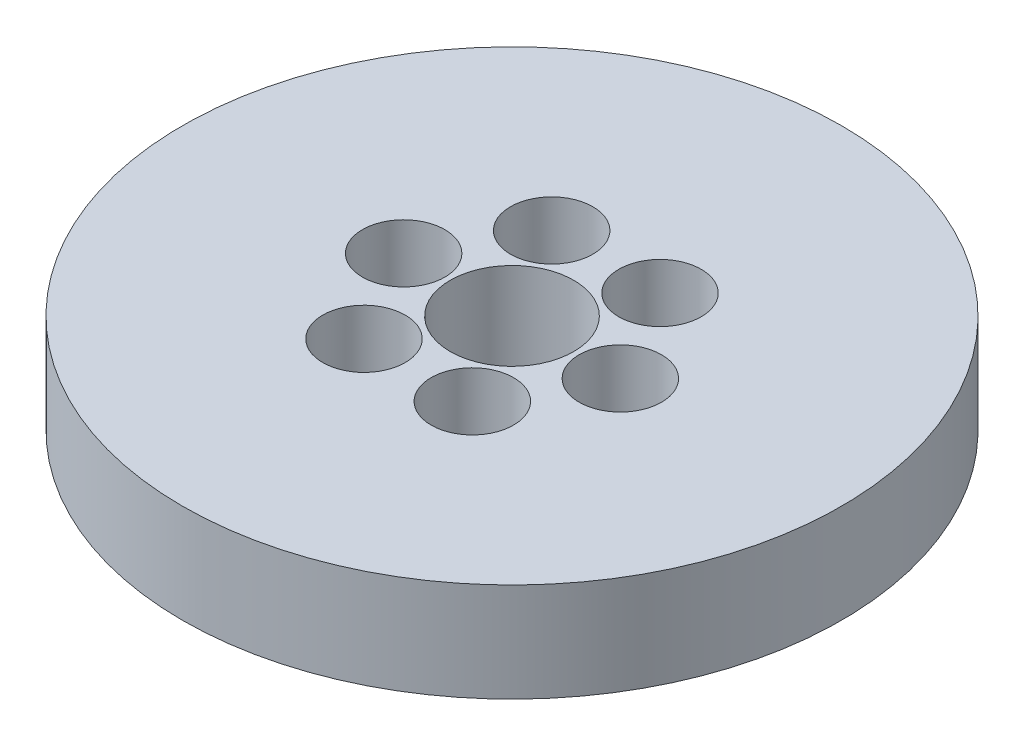
ISO-10303-21;
HEADER;
FILE_DESCRIPTION(('STEP AP214'),'2;1');
FILE_NAME('part.step','',(''),(''),'','','');
FILE_SCHEMA(('AUTOMOTIVE_DESIGN { 1 0 10303 214 1 1 1 1 }'));
ENDSEC;
DATA;
#1=APPLICATION_CONTEXT('core data for automotive mechanical design processes');
#2=APPLICATION_PROTOCOL_DEFINITION('international standard','automotive_design',2000,#1);
#3=PRODUCT_CONTEXT('',#1,'mechanical');
#4=PRODUCT('Part','Part','',(#3));
#5=PRODUCT_RELATED_PRODUCT_CATEGORY('part','',(#4));
#6=PRODUCT_DEFINITION_FORMATION('','',#4);
#7=PRODUCT_DEFINITION_CONTEXT('part definition',#1,'design');
#8=PRODUCT_DEFINITION('design','',#6,#7);
#9=PRODUCT_DEFINITION_SHAPE('','',#8);
#10=(LENGTH_UNIT() NAMED_UNIT(*) SI_UNIT(.MILLI.,.METRE.));
#11=(NAMED_UNIT(*) PLANE_ANGLE_UNIT() SI_UNIT($,.RADIAN.));
#12=(NAMED_UNIT(*) SI_UNIT($,.STERADIAN.) SOLID_ANGLE_UNIT());
#13=UNCERTAINTY_MEASURE_WITH_UNIT(LENGTH_MEASURE(1.E-05),#10,'distance_accuracy_value','');
#14=(GEOMETRIC_REPRESENTATION_CONTEXT(3) GLOBAL_UNCERTAINTY_ASSIGNED_CONTEXT((#13)) GLOBAL_UNIT_ASSIGNED_CONTEXT((#10,
#11,#12)) REPRESENTATION_CONTEXT('',''));
#15=CARTESIAN_POINT('',(0.,0.,0.));
#16=DIRECTION('',(0.,0.,1.));
#17=DIRECTION('',(1.,0.,0.));
#18=AXIS2_PLACEMENT_3D('',#15,#16,#17);
#19=CARTESIAN_POINT('',(0.,24.,0.));
#20=DIRECTION('',(0.,-1.,0.));
#21=DIRECTION('',(0.,0.,-1.));
#22=AXIS2_PLACEMENT_3D('',#19,#20,#21);
#23=CYLINDRICAL_SURFACE('',#22,80.);
#24=CARTESIAN_POINT('',(0.,24.,0.));
#25=DIRECTION('',(0.,1.,0.));
#26=DIRECTION('',(0.,0.,1.));
#27=AXIS2_PLACEMENT_3D('',#24,#25,#26);
#28=CIRCLE('',#27,80.);
#29=CARTESIAN_POINT('',(0.,24.,80.));
#30=VERTEX_POINT('',#29);
#31=EDGE_CURVE('E10',#30,#30,#28,.T.);
#32=ORIENTED_EDGE('',*,*,#31,.F.);
#33=EDGE_LOOP('',(#32));
#34=FACE_BOUND('',#33,.T.);
#35=CARTESIAN_POINT('',(0.,0.,0.));
#36=DIRECTION('',(0.,1.,0.));
#37=DIRECTION('',(0.,0.,1.));
#38=AXIS2_PLACEMENT_3D('',#35,#36,#37);
#39=CIRCLE('',#38,80.);
#40=CARTESIAN_POINT('',(0.,0.,80.));
#41=VERTEX_POINT('',#40);
#42=EDGE_CURVE('E37',#41,#41,#39,.T.);
#43=ORIENTED_EDGE('',*,*,#42,.T.);
#44=EDGE_LOOP('',(#43));
#45=FACE_BOUND('',#44,.T.);
#46=ADVANCED_FACE('F40',(#34,#45),#23,.T.);
#47=CARTESIAN_POINT('',(0.,24.,0.));
#48=DIRECTION('',(0.,1.,0.));
#49=DIRECTION('',(0.,0.,1.));
#50=AXIS2_PLACEMENT_3D('',#47,#48,#49);
#51=PLANE('',#50);
#52=CARTESIAN_POINT('',(-13.1505792721766,24.,-22.7774714483715));
#53=DIRECTION('',(0.,1.,0.));
#54=DIRECTION('',(-0.866025403784433,0.,0.50000000000001));
#55=AXIS2_PLACEMENT_3D('',#52,#53,#54);
#56=CIRCLE('',#55,10.);
#57=CARTESIAN_POINT('',(-21.810833310021,24.,-17.7774714483714));
#58=VERTEX_POINT('',#57);
#59=EDGE_CURVE('E70',#58,#58,#56,.T.);
#60=ORIENTED_EDGE('',*,*,#59,.F.);
#61=EDGE_LOOP('',(#60));
#62=FACE_BOUND('',#61,.T.);
#63=CARTESIAN_POINT('',(13.1505792721762,24.,-22.7774714483717));
#64=DIRECTION('',(0.,1.,0.));
#65=DIRECTION('',(-0.866025403784443,0.,-0.499999999999992));
#66=AXIS2_PLACEMENT_3D('',#63,#64,#65);
#67=CIRCLE('',#66,10.);
#68=CARTESIAN_POINT('',(4.49032523433172,24.,-27.7774714483716));
#69=VERTEX_POINT('',#68);
#70=EDGE_CURVE('E71',#69,#69,#67,.T.);
#71=ORIENTED_EDGE('',*,*,#70,.F.);
#72=EDGE_LOOP('',(#71));
#73=FACE_BOUND('',#72,.T.);
#74=CARTESIAN_POINT('',(26.3011585443527,24.,0.));
#75=DIRECTION('',(0.,1.,0.));
#76=DIRECTION('',(0.,0.,-1.));
#77=AXIS2_PLACEMENT_3D('',#74,#75,#76);
#78=CIRCLE('',#77,10.);
#79=CARTESIAN_POINT('',(26.3011585443527,24.,-10.));
#80=VERTEX_POINT('',#79);
#81=EDGE_CURVE('E78',#80,#80,#78,.T.);
#82=ORIENTED_EDGE('',*,*,#81,.F.);
#83=EDGE_LOOP('',(#82));
#84=FACE_BOUND('',#83,.T.);
#85=CARTESIAN_POINT('',(13.1505792721765,24.,22.7774714483716));
#86=DIRECTION('',(0.,1.,0.));
#87=DIRECTION('',(0.866025403784436,0.,-0.500000000000004));
#88=AXIS2_PLACEMENT_3D('',#85,#86,#87);
#89=CIRCLE('',#88,10.);
#90=CARTESIAN_POINT('',(21.8108333100208,24.,17.7774714483715));
#91=VERTEX_POINT('',#90);
#92=EDGE_CURVE('E84',#91,#91,#89,.T.);
#93=ORIENTED_EDGE('',*,*,#92,.F.);
#94=EDGE_LOOP('',(#93));
#95=FACE_BOUND('',#94,.T.);
#96=CARTESIAN_POINT('',(-13.1505792721763,24.,22.7774714483716));
#97=DIRECTION('',(0.,1.,0.));
#98=DIRECTION('',(0.86602540378444,0.,0.499999999999998));
#99=AXIS2_PLACEMENT_3D('',#96,#97,#98);
#100=CIRCLE('',#99,10.);
#101=CARTESIAN_POINT('',(-4.49032523433192,24.,27.7774714483716));
#102=VERTEX_POINT('',#101);
#103=EDGE_CURVE('E61',#102,#102,#100,.T.);
#104=ORIENTED_EDGE('',*,*,#103,.F.);
#105=EDGE_LOOP('',(#104));
#106=FACE_BOUND('',#105,.T.);
#107=CARTESIAN_POINT('',(-26.3011585443527,24.,0.));
#108=DIRECTION('',(0.,1.,0.));
#109=DIRECTION('',(0.,0.,1.));
#110=AXIS2_PLACEMENT_3D('',#107,#108,#109);
#111=CIRCLE('',#110,10.);
#112=CARTESIAN_POINT('',(-26.3011585443527,24.,10.));
#113=VERTEX_POINT('',#112);
#114=EDGE_CURVE('E54',#113,#113,#111,.T.);
#115=ORIENTED_EDGE('',*,*,#114,.F.);
#116=EDGE_LOOP('',(#115));
#117=FACE_BOUND('',#116,.T.);
#118=CARTESIAN_POINT('',(0.,24.,0.));
#119=DIRECTION('',(0.,1.,0.));
#120=DIRECTION('',(0.,0.,1.));
#121=AXIS2_PLACEMENT_3D('',#118,#119,#120);
#122=CIRCLE('',#121,15.);
#123=CARTESIAN_POINT('',(0.,24.,15.));
#124=VERTEX_POINT('',#123);
#125=EDGE_CURVE('E50',#124,#124,#122,.T.);
#126=ORIENTED_EDGE('',*,*,#125,.F.);
#127=EDGE_LOOP('',(#126));
#128=FACE_BOUND('',#127,.T.);
#129=ORIENTED_EDGE('',*,*,#31,.T.);
#130=EDGE_LOOP('',(#129));
#131=FACE_BOUND('',#130,.T.);
#132=ADVANCED_FACE('F99',(#62,#73,#84,#95,#106,#117,#128,#131),#51,.T.);
#133=CARTESIAN_POINT('',(0.,0.,0.));
#134=DIRECTION('',(0.,1.,0.));
#135=DIRECTION('',(0.,0.,1.));
#136=AXIS2_PLACEMENT_3D('',#133,#134,#135);
#137=PLANE('',#136);
#138=CARTESIAN_POINT('',(0.,0.,0.));
#139=DIRECTION('',(0.,1.,0.));
#140=DIRECTION('',(0.,0.,1.));
#141=AXIS2_PLACEMENT_3D('',#138,#139,#140);
#142=CIRCLE('',#141,15.);
#143=CARTESIAN_POINT('',(0.,0.,15.));
#144=VERTEX_POINT('',#143);
#145=EDGE_CURVE('E47',#144,#144,#142,.T.);
#146=ORIENTED_EDGE('',*,*,#145,.T.);
#147=EDGE_LOOP('',(#146));
#148=FACE_BOUND('',#147,.T.);
#149=ORIENTED_EDGE('',*,*,#42,.F.);
#150=EDGE_LOOP('',(#149));
#151=FACE_BOUND('',#150,.T.);
#152=ADVANCED_FACE('F103',(#148,#151),#137,.F.);
#153=CARTESIAN_POINT('',(0.,24.,0.));
#154=DIRECTION('',(0.,-1.,0.));
#155=DIRECTION('',(0.,0.,-1.));
#156=AXIS2_PLACEMENT_3D('',#153,#154,#155);
#157=CYLINDRICAL_SURFACE('',#156,15.);
#158=ORIENTED_EDGE('',*,*,#125,.T.);
#159=EDGE_LOOP('',(#158));
#160=FACE_BOUND('',#159,.T.);
#161=ORIENTED_EDGE('',*,*,#145,.F.);
#162=EDGE_LOOP('',(#161));
#163=FACE_BOUND('',#162,.T.);
#164=ADVANCED_FACE('F115',(#160,#163),#157,.F.);
#165=CARTESIAN_POINT('',(-26.3011585443527,9.47864339809068,0.));
#166=DIRECTION('',(0.,1.,0.));
#167=DIRECTION('',(0.,0.,1.));
#168=AXIS2_PLACEMENT_3D('',#165,#166,#167);
#169=CYLINDRICAL_SURFACE('',#168,10.);
#170=CARTESIAN_POINT('',(-26.3011585443527,9.47864339809068,0.));
#171=DIRECTION('',(0.,1.,0.));
#172=DIRECTION('',(0.,0.,1.));
#173=AXIS2_PLACEMENT_3D('',#170,#171,#172);
#174=CIRCLE('',#173,10.);
#175=CARTESIAN_POINT('',(-26.3011585443527,9.47864339809068,10.));
#176=VERTEX_POINT('',#175);
#177=EDGE_CURVE('E55',#176,#176,#174,.T.);
#178=ORIENTED_EDGE('',*,*,#177,.F.);
#179=EDGE_LOOP('',(#178));
#180=FACE_BOUND('',#179,.T.);
#181=ORIENTED_EDGE('',*,*,#114,.T.);
#182=EDGE_LOOP('',(#181));
#183=FACE_BOUND('',#182,.T.);
#184=ADVANCED_FACE('F113',(#180,#183),#169,.F.);
#185=CARTESIAN_POINT('',(-26.3011585443527,9.47864339809068,0.));
#186=DIRECTION('',(0.,1.,0.));
#187=DIRECTION('',(0.,0.,1.));
#188=AXIS2_PLACEMENT_3D('',#185,#186,#187);
#189=PLANE('',#188);
#190=ORIENTED_EDGE('',*,*,#177,.T.);
#191=EDGE_LOOP('',(#190));
#192=FACE_BOUND('',#191,.T.);
#193=ADVANCED_FACE('F144',(#192),#189,.T.);
#194=CARTESIAN_POINT('',(-13.1505792721763,9.47864339809068,22.7774714483716));
#195=DIRECTION('',(0.,1.,0.));
#196=DIRECTION('',(0.,0.,1.));
#197=AXIS2_PLACEMENT_3D('',#194,#195,#196);
#198=CYLINDRICAL_SURFACE('',#197,10.);
#199=CARTESIAN_POINT('',(-13.1505792721763,9.47864339809068,22.7774714483716));
#200=DIRECTION('',(0.,1.,0.));
#201=DIRECTION('',(0.86602540378444,0.,0.499999999999998));
#202=AXIS2_PLACEMENT_3D('',#199,#200,#201);
#203=CIRCLE('',#202,10.);
#204=CARTESIAN_POINT('',(-4.49032523433192,9.47864339809068,27.7774714483716));
#205=VERTEX_POINT('',#204);
#206=EDGE_CURVE('E59',#205,#205,#203,.T.);
#207=ORIENTED_EDGE('',*,*,#206,.F.);
#208=EDGE_LOOP('',(#207));
#209=FACE_BOUND('',#208,.T.);
#210=ORIENTED_EDGE('',*,*,#103,.T.);
#211=EDGE_LOOP('',(#210));
#212=FACE_BOUND('',#211,.T.);
#213=ADVANCED_FACE('F153',(#209,#212),#198,.F.);
#214=CARTESIAN_POINT('',(-13.1505792721763,9.47864339809068,22.7774714483716));
#215=DIRECTION('',(0.,1.,0.));
#216=DIRECTION('',(0.86602540378444,0.,0.499999999999998));
#217=AXIS2_PLACEMENT_3D('',#214,#215,#216);
#218=PLANE('',#217);
#219=ORIENTED_EDGE('',*,*,#206,.T.);
#220=EDGE_LOOP('',(#219));
#221=FACE_BOUND('',#220,.T.);
#222=ADVANCED_FACE('F96',(#221),#218,.T.);
#223=CARTESIAN_POINT('',(13.1505792721765,9.47864339809068,22.7774714483716));
#224=DIRECTION('',(0.,1.,0.));
#225=DIRECTION('',(0.,0.,1.));
#226=AXIS2_PLACEMENT_3D('',#223,#224,#225);
#227=CYLINDRICAL_SURFACE('',#226,10.);
#228=CARTESIAN_POINT('',(13.1505792721765,9.47864339809068,22.7774714483716));
#229=DIRECTION('',(0.,1.,0.));
#230=DIRECTION('',(0.866025403784436,0.,-0.500000000000004));
#231=AXIS2_PLACEMENT_3D('',#228,#229,#230);
#232=CIRCLE('',#231,10.);
#233=CARTESIAN_POINT('',(21.8108333100208,9.47864339809068,17.7774714483715));
#234=VERTEX_POINT('',#233);
#235=EDGE_CURVE('E63',#234,#234,#232,.T.);
#236=ORIENTED_EDGE('',*,*,#235,.F.);
#237=EDGE_LOOP('',(#236));
#238=FACE_BOUND('',#237,.T.);
#239=ORIENTED_EDGE('',*,*,#92,.T.);
#240=EDGE_LOOP('',(#239));
#241=FACE_BOUND('',#240,.T.);
#242=ADVANCED_FACE('F91',(#238,#241),#227,.F.);
#243=CARTESIAN_POINT('',(13.1505792721765,9.47864339809068,22.7774714483716));
#244=DIRECTION('',(0.,1.,0.));
#245=DIRECTION('',(0.866025403784436,0.,-0.500000000000004));
#246=AXIS2_PLACEMENT_3D('',#243,#244,#245);
#247=PLANE('',#246);
#248=ORIENTED_EDGE('',*,*,#235,.T.);
#249=EDGE_LOOP('',(#248));
#250=FACE_BOUND('',#249,.T.);
#251=ADVANCED_FACE('F93',(#250),#247,.T.);
#252=CARTESIAN_POINT('',(26.3011585443527,9.47864339809068,0.));
#253=DIRECTION('',(0.,1.,0.));
#254=DIRECTION('',(0.,0.,1.));
#255=AXIS2_PLACEMENT_3D('',#252,#253,#254);
#256=CYLINDRICAL_SURFACE('',#255,10.);
#257=CARTESIAN_POINT('',(26.3011585443527,9.47864339809068,0.));
#258=DIRECTION('',(0.,1.,0.));
#259=DIRECTION('',(0.,0.,-1.));
#260=AXIS2_PLACEMENT_3D('',#257,#258,#259);
#261=CIRCLE('',#260,10.);
#262=CARTESIAN_POINT('',(26.3011585443527,9.47864339809068,-10.));
#263=VERTEX_POINT('',#262);
#264=EDGE_CURVE('E85',#263,#263,#261,.T.);
#265=ORIENTED_EDGE('',*,*,#264,.F.);
#266=EDGE_LOOP('',(#265));
#267=FACE_BOUND('',#266,.T.);
#268=ORIENTED_EDGE('',*,*,#81,.T.);
#269=EDGE_LOOP('',(#268));
#270=FACE_BOUND('',#269,.T.);
#271=ADVANCED_FACE('F187',(#267,#270),#256,.F.);
#272=CARTESIAN_POINT('',(26.3011585443527,9.47864339809068,0.));
#273=DIRECTION('',(0.,1.,0.));
#274=DIRECTION('',(0.,0.,-1.));
#275=AXIS2_PLACEMENT_3D('',#272,#273,#274);
#276=PLANE('',#275);
#277=ORIENTED_EDGE('',*,*,#264,.T.);
#278=EDGE_LOOP('',(#277));
#279=FACE_BOUND('',#278,.T.);
#280=ADVANCED_FACE('F198',(#279),#276,.T.);
#281=CARTESIAN_POINT('',(13.1505792721762,9.47864339809068,-22.7774714483717));
#282=DIRECTION('',(0.,1.,0.));
#283=DIRECTION('',(0.,0.,1.));
#284=AXIS2_PLACEMENT_3D('',#281,#282,#283);
#285=CYLINDRICAL_SURFACE('',#284,10.);
#286=CARTESIAN_POINT('',(13.1505792721762,9.47864339809068,-22.7774714483717));
#287=DIRECTION('',(0.,1.,0.));
#288=DIRECTION('',(-0.866025403784443,0.,-0.499999999999992));
#289=AXIS2_PLACEMENT_3D('',#286,#287,#288);
#290=CIRCLE('',#289,10.);
#291=CARTESIAN_POINT('',(4.49032523433172,9.47864339809068,-27.7774714483716));
#292=VERTEX_POINT('',#291);
#293=EDGE_CURVE('E76',#292,#292,#290,.T.);
#294=ORIENTED_EDGE('',*,*,#293,.F.);
#295=EDGE_LOOP('',(#294));
#296=FACE_BOUND('',#295,.T.);
#297=ORIENTED_EDGE('',*,*,#70,.T.);
#298=EDGE_LOOP('',(#297));
#299=FACE_BOUND('',#298,.T.);
#300=ADVANCED_FACE('F202',(#296,#299),#285,.F.);
#301=CARTESIAN_POINT('',(13.1505792721762,9.47864339809068,-22.7774714483717));
#302=DIRECTION('',(0.,1.,0.));
#303=DIRECTION('',(-0.866025403784443,0.,-0.499999999999992));
#304=AXIS2_PLACEMENT_3D('',#301,#302,#303);
#305=PLANE('',#304);
#306=ORIENTED_EDGE('',*,*,#293,.T.);
#307=EDGE_LOOP('',(#306));
#308=FACE_BOUND('',#307,.T.);
#309=ADVANCED_FACE('F212',(#308),#305,.T.);
#310=CARTESIAN_POINT('',(-13.1505792721766,9.47864339809068,-22.7774714483715));
#311=DIRECTION('',(0.,1.,0.));
#312=DIRECTION('',(0.,0.,1.));
#313=AXIS2_PLACEMENT_3D('',#310,#311,#312);
#314=CYLINDRICAL_SURFACE('',#313,10.);
#315=CARTESIAN_POINT('',(-13.1505792721766,9.47864339809068,-22.7774714483715));
#316=DIRECTION('',(0.,1.,0.));
#317=DIRECTION('',(-0.866025403784433,0.,0.50000000000001));
#318=AXIS2_PLACEMENT_3D('',#315,#316,#317);
#319=CIRCLE('',#318,10.);
#320=CARTESIAN_POINT('',(-21.810833310021,9.47864339809068,-17.7774714483714));
#321=VERTEX_POINT('',#320);
#322=EDGE_CURVE('E69',#321,#321,#319,.T.);
#323=ORIENTED_EDGE('',*,*,#322,.F.);
#324=EDGE_LOOP('',(#323));
#325=FACE_BOUND('',#324,.T.);
#326=ORIENTED_EDGE('',*,*,#59,.T.);
#327=EDGE_LOOP('',(#326));
#328=FACE_BOUND('',#327,.T.);
#329=ADVANCED_FACE('F224',(#325,#328),#314,.F.);
#330=CARTESIAN_POINT('',(-13.1505792721766,9.47864339809068,-22.7774714483715));
#331=DIRECTION('',(0.,1.,0.));
#332=DIRECTION('',(-0.866025403784433,0.,0.50000000000001));
#333=AXIS2_PLACEMENT_3D('',#330,#331,#332);
#334=PLANE('',#333);
#335=ORIENTED_EDGE('',*,*,#322,.T.);
#336=EDGE_LOOP('',(#335));
#337=FACE_BOUND('',#336,.T.);
#338=ADVANCED_FACE('F235',(#337),#334,.T.);
#339=CLOSED_SHELL('',(#46,#132,#152,#164,#184,#193,#213,#222,#242,#251,#271,#280,#300,#309,#329,#338));
#340=MANIFOLD_SOLID_BREP('B2',#339);
#341=ADVANCED_BREP_SHAPE_REPRESENTATION('',(#18,#340),#14);
#342=SHAPE_DEFINITION_REPRESENTATION(#9,#341);
ENDSEC;
END-ISO-10303-21;
